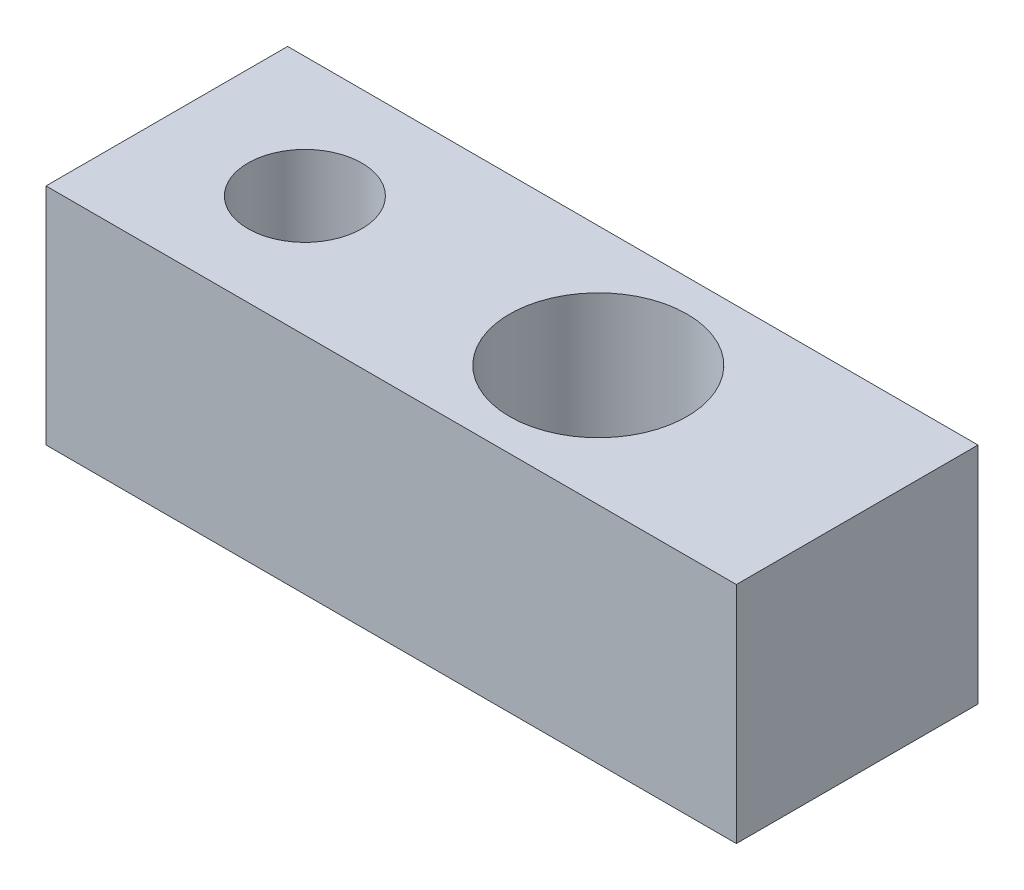
ISO-10303-21;
HEADER;
FILE_DESCRIPTION(('STEP AP214'),'2;1');
FILE_NAME('part.step','',(''),(''),'','','');
FILE_SCHEMA(('AUTOMOTIVE_DESIGN { 1 0 10303 214 1 1 1 1 }'));
ENDSEC;
DATA;
#1=APPLICATION_CONTEXT('core data for automotive mechanical design processes');
#2=APPLICATION_PROTOCOL_DEFINITION('international standard','automotive_design',2000,#1);
#3=PRODUCT_CONTEXT('',#1,'mechanical');
#4=PRODUCT('Part','Part','',(#3));
#5=PRODUCT_RELATED_PRODUCT_CATEGORY('part','',(#4));
#6=PRODUCT_DEFINITION_FORMATION('','',#4);
#7=PRODUCT_DEFINITION_CONTEXT('part definition',#1,'design');
#8=PRODUCT_DEFINITION('design','',#6,#7);
#9=PRODUCT_DEFINITION_SHAPE('','',#8);
#10=(LENGTH_UNIT() NAMED_UNIT(*) SI_UNIT(.MILLI.,.METRE.));
#11=(NAMED_UNIT(*) PLANE_ANGLE_UNIT() SI_UNIT($,.RADIAN.));
#12=(NAMED_UNIT(*) SI_UNIT($,.STERADIAN.) SOLID_ANGLE_UNIT());
#13=UNCERTAINTY_MEASURE_WITH_UNIT(LENGTH_MEASURE(1.E-05),#10,'distance_accuracy_value','');
#14=(GEOMETRIC_REPRESENTATION_CONTEXT(3) GLOBAL_UNCERTAINTY_ASSIGNED_CONTEXT((#13)) GLOBAL_UNIT_ASSIGNED_CONTEXT((#10,
#11,#12)) REPRESENTATION_CONTEXT('',''));
#15=CARTESIAN_POINT('',(0.,0.,0.));
#16=DIRECTION('',(0.,0.,1.));
#17=DIRECTION('',(1.,0.,0.));
#18=AXIS2_PLACEMENT_3D('',#15,#16,#17);
#19=CARTESIAN_POINT('',(0.,6.5,0.));
#20=DIRECTION('',(0.,1.,0.));
#21=DIRECTION('',(0.,0.,1.));
#22=AXIS2_PLACEMENT_3D('',#19,#20,#21);
#23=PLANE('',#22);
#24=CARTESIAN_POINT('',(0.,6.5,0.));
#25=DIRECTION('',(0.,1.,0.));
#26=DIRECTION('',(0.,0.,1.));
#27=AXIS2_PLACEMENT_3D('',#24,#25,#26);
#28=CIRCLE('',#27,1.65);
#29=CARTESIAN_POINT('',(0.,6.5,1.65));
#30=VERTEX_POINT('',#29);
#31=EDGE_CURVE('E104',#30,#30,#28,.T.);
#32=ORIENTED_EDGE('',*,*,#31,.F.);
#33=EDGE_LOOP('',(#32));
#34=FACE_BOUND('',#33,.T.);
#35=DIRECTION('',(0.,0.,-1.));
#36=VECTOR('',#35,1.);
#37=CARTESIAN_POINT('',(16.,6.5,-3.5));
#38=LINE('',#37,#36);
#39=CARTESIAN_POINT('',(16.,6.5,3.5));
#40=VERTEX_POINT('',#39);
#41=CARTESIAN_POINT('',(16.,6.5,-3.5));
#42=VERTEX_POINT('',#41);
#43=EDGE_CURVE('E89',#40,#42,#38,.T.);
#44=ORIENTED_EDGE('',*,*,#43,.T.);
#45=DIRECTION('',(-1.,0.,0.));
#46=VECTOR('',#45,1.);
#47=CARTESIAN_POINT('',(-4.,6.5,-3.5));
#48=LINE('',#47,#46);
#49=CARTESIAN_POINT('',(-4.,6.5,-3.5));
#50=VERTEX_POINT('',#49);
#51=EDGE_CURVE('E84',#42,#50,#48,.T.);
#52=ORIENTED_EDGE('',*,*,#51,.T.);
#53=DIRECTION('',(0.,0.,1.));
#54=VECTOR('',#53,1.);
#55=CARTESIAN_POINT('',(-4.,6.5,-3.5));
#56=LINE('',#55,#54);
#57=CARTESIAN_POINT('',(-4.,6.5,3.5));
#58=VERTEX_POINT('',#57);
#59=EDGE_CURVE('E87',#50,#58,#56,.T.);
#60=ORIENTED_EDGE('',*,*,#59,.T.);
#61=DIRECTION('',(1.,0.,0.));
#62=VECTOR('',#61,1.);
#63=CARTESIAN_POINT('',(-4.,6.5,3.5));
#64=LINE('',#63,#62);
#65=EDGE_CURVE('E54',#58,#40,#64,.T.);
#66=ORIENTED_EDGE('',*,*,#65,.T.);
#67=EDGE_LOOP('',(#44,#52,#60,#66));
#68=FACE_BOUND('',#67,.T.);
#69=CARTESIAN_POINT('',(8.5,6.5,0.));
#70=DIRECTION('',(0.,1.,0.));
#71=DIRECTION('',(0.,0.,1.));
#72=AXIS2_PLACEMENT_3D('',#69,#70,#71);
#73=CIRCLE('',#72,2.57185731061892);
#74=CARTESIAN_POINT('',(8.5,6.5,2.57185731061892));
#75=VERTEX_POINT('',#74);
#76=EDGE_CURVE('E119',#75,#75,#73,.T.);
#77=ORIENTED_EDGE('',*,*,#76,.F.);
#78=EDGE_LOOP('',(#77));
#79=FACE_BOUND('',#78,.T.);
#80=ADVANCED_FACE('F37',(#34,#68,#79),#23,.T.);
#81=CARTESIAN_POINT('',(0.,0.,0.));
#82=DIRECTION('',(0.,1.,0.));
#83=DIRECTION('',(0.,0.,1.));
#84=AXIS2_PLACEMENT_3D('',#81,#82,#83);
#85=PLANE('',#84);
#86=DIRECTION('',(0.,0.,-1.));
#87=VECTOR('',#86,1.);
#88=CARTESIAN_POINT('',(16.,0.,-3.5));
#89=LINE('',#88,#87);
#90=CARTESIAN_POINT('',(16.,0.,3.5));
#91=VERTEX_POINT('',#90);
#92=CARTESIAN_POINT('',(16.,0.,-3.5));
#93=VERTEX_POINT('',#92);
#94=EDGE_CURVE('E101',#91,#93,#89,.T.);
#95=ORIENTED_EDGE('',*,*,#94,.F.);
#96=DIRECTION('',(1.,0.,0.));
#97=VECTOR('',#96,1.);
#98=CARTESIAN_POINT('',(-4.,0.,3.5));
#99=LINE('',#98,#97);
#100=CARTESIAN_POINT('',(-4.,0.,3.5));
#101=VERTEX_POINT('',#100);
#102=EDGE_CURVE('E77',#101,#91,#99,.T.);
#103=ORIENTED_EDGE('',*,*,#102,.F.);
#104=DIRECTION('',(0.,0.,1.));
#105=VECTOR('',#104,1.);
#106=CARTESIAN_POINT('',(-4.,0.,-3.5));
#107=LINE('',#106,#105);
#108=CARTESIAN_POINT('',(-4.,0.,-3.5));
#109=VERTEX_POINT('',#108);
#110=EDGE_CURVE('E71',#109,#101,#107,.T.);
#111=ORIENTED_EDGE('',*,*,#110,.F.);
#112=DIRECTION('',(-1.,0.,0.));
#113=VECTOR('',#112,1.);
#114=CARTESIAN_POINT('',(-4.,0.,-3.5));
#115=LINE('',#114,#113);
#116=EDGE_CURVE('E93',#93,#109,#115,.T.);
#117=ORIENTED_EDGE('',*,*,#116,.F.);
#118=EDGE_LOOP('',(#95,#103,#111,#117));
#119=FACE_BOUND('',#118,.T.);
#120=CARTESIAN_POINT('',(0.,0.,0.));
#121=DIRECTION('',(0.,1.,0.));
#122=DIRECTION('',(0.,0.,1.));
#123=AXIS2_PLACEMENT_3D('',#120,#121,#122);
#124=CIRCLE('',#123,1.65);
#125=CARTESIAN_POINT('',(0.,0.,1.65));
#126=VERTEX_POINT('',#125);
#127=EDGE_CURVE('E116',#126,#126,#124,.T.);
#128=ORIENTED_EDGE('',*,*,#127,.T.);
#129=EDGE_LOOP('',(#128));
#130=FACE_BOUND('',#129,.T.);
#131=CARTESIAN_POINT('',(8.5,0.,0.));
#132=DIRECTION('',(0.,1.,0.));
#133=DIRECTION('',(0.,0.,1.));
#134=AXIS2_PLACEMENT_3D('',#131,#132,#133);
#135=CIRCLE('',#134,2.57185731061892);
#136=CARTESIAN_POINT('',(8.5,0.,2.57185731061892));
#137=VERTEX_POINT('',#136);
#138=EDGE_CURVE('E122',#137,#137,#135,.T.);
#139=ORIENTED_EDGE('',*,*,#138,.T.);
#140=EDGE_LOOP('',(#139));
#141=FACE_BOUND('',#140,.T.);
#142=ADVANCED_FACE('F112',(#119,#130,#141),#85,.F.);
#143=CARTESIAN_POINT('',(16.,6.5,-3.5));
#144=DIRECTION('',(-1.,0.,0.));
#145=DIRECTION('',(0.,0.,1.));
#146=AXIS2_PLACEMENT_3D('',#143,#144,#145);
#147=PLANE('',#146);
#148=ORIENTED_EDGE('',*,*,#94,.T.);
#149=DIRECTION('',(0.,-1.,0.));
#150=VECTOR('',#149,1.);
#151=CARTESIAN_POINT('',(16.,6.5,-3.5));
#152=LINE('',#151,#150);
#153=EDGE_CURVE('E11',#42,#93,#152,.T.);
#154=ORIENTED_EDGE('',*,*,#153,.F.);
#155=ORIENTED_EDGE('',*,*,#43,.F.);
#156=DIRECTION('',(0.,-1.,0.));
#157=VECTOR('',#156,1.);
#158=CARTESIAN_POINT('',(16.,6.5,3.5));
#159=LINE('',#158,#157);
#160=EDGE_CURVE('E97',#40,#91,#159,.T.);
#161=ORIENTED_EDGE('',*,*,#160,.T.);
#162=EDGE_LOOP('',(#148,#154,#155,#161));
#163=FACE_BOUND('',#162,.T.);
#164=ADVANCED_FACE('F39',(#163),#147,.F.);
#165=CARTESIAN_POINT('',(-4.,6.5,-3.5));
#166=DIRECTION('',(0.,0.,1.));
#167=DIRECTION('',(1.,0.,0.));
#168=AXIS2_PLACEMENT_3D('',#165,#166,#167);
#169=PLANE('',#168);
#170=ORIENTED_EDGE('',*,*,#116,.T.);
#171=DIRECTION('',(0.,-1.,0.));
#172=VECTOR('',#171,1.);
#173=CARTESIAN_POINT('',(-4.,6.5,-3.5));
#174=LINE('',#173,#172);
#175=EDGE_CURVE('E46',#50,#109,#174,.T.);
#176=ORIENTED_EDGE('',*,*,#175,.F.);
#177=ORIENTED_EDGE('',*,*,#51,.F.);
#178=ORIENTED_EDGE('',*,*,#153,.T.);
#179=EDGE_LOOP('',(#170,#176,#177,#178));
#180=FACE_BOUND('',#179,.T.);
#181=ADVANCED_FACE('F92',(#180),#169,.F.);
#182=CARTESIAN_POINT('',(-4.,6.5,-3.5));
#183=DIRECTION('',(1.,0.,0.));
#184=DIRECTION('',(0.,0.,-1.));
#185=AXIS2_PLACEMENT_3D('',#182,#183,#184);
#186=PLANE('',#185);
#187=ORIENTED_EDGE('',*,*,#110,.T.);
#188=DIRECTION('',(0.,-1.,0.));
#189=VECTOR('',#188,1.);
#190=CARTESIAN_POINT('',(-4.,6.5,3.5));
#191=LINE('',#190,#189);
#192=EDGE_CURVE('E94',#58,#101,#191,.T.);
#193=ORIENTED_EDGE('',*,*,#192,.F.);
#194=ORIENTED_EDGE('',*,*,#59,.F.);
#195=ORIENTED_EDGE('',*,*,#175,.T.);
#196=EDGE_LOOP('',(#187,#193,#194,#195));
#197=FACE_BOUND('',#196,.T.);
#198=ADVANCED_FACE('F95',(#197),#186,.F.);
#199=CARTESIAN_POINT('',(-4.,6.5,3.5));
#200=DIRECTION('',(0.,0.,-1.));
#201=DIRECTION('',(-1.,0.,0.));
#202=AXIS2_PLACEMENT_3D('',#199,#200,#201);
#203=PLANE('',#202);
#204=ORIENTED_EDGE('',*,*,#102,.T.);
#205=ORIENTED_EDGE('',*,*,#160,.F.);
#206=ORIENTED_EDGE('',*,*,#65,.F.);
#207=ORIENTED_EDGE('',*,*,#192,.T.);
#208=EDGE_LOOP('',(#204,#205,#206,#207));
#209=FACE_BOUND('',#208,.T.);
#210=ADVANCED_FACE('F109',(#209),#203,.F.);
#211=CARTESIAN_POINT('',(0.,6.5,0.));
#212=DIRECTION('',(0.,-1.,0.));
#213=DIRECTION('',(0.,0.,-1.));
#214=AXIS2_PLACEMENT_3D('',#211,#212,#213);
#215=CYLINDRICAL_SURFACE('',#214,1.65);
#216=ORIENTED_EDGE('',*,*,#31,.T.);
#217=EDGE_LOOP('',(#216));
#218=FACE_BOUND('',#217,.T.);
#219=ORIENTED_EDGE('',*,*,#127,.F.);
#220=EDGE_LOOP('',(#219));
#221=FACE_BOUND('',#220,.T.);
#222=ADVANCED_FACE('F139',(#218,#221),#215,.F.);
#223=CARTESIAN_POINT('',(8.5,6.5,0.));
#224=DIRECTION('',(0.,-1.,0.));
#225=DIRECTION('',(0.,0.,-1.));
#226=AXIS2_PLACEMENT_3D('',#223,#224,#225);
#227=CYLINDRICAL_SURFACE('',#226,2.57185731061892);
#228=ORIENTED_EDGE('',*,*,#76,.T.);
#229=EDGE_LOOP('',(#228));
#230=FACE_BOUND('',#229,.T.);
#231=ORIENTED_EDGE('',*,*,#138,.F.);
#232=EDGE_LOOP('',(#231));
#233=FACE_BOUND('',#232,.T.);
#234=ADVANCED_FACE('F128',(#230,#233),#227,.F.);
#235=CLOSED_SHELL('',(#80,#142,#164,#181,#198,#210,#222,#234));
#236=MANIFOLD_SOLID_BREP('B2',#235);
#237=ADVANCED_BREP_SHAPE_REPRESENTATION('',(#18,#236),#14);
#238=SHAPE_DEFINITION_REPRESENTATION(#9,#237);
ENDSEC;
END-ISO-10303-21;
